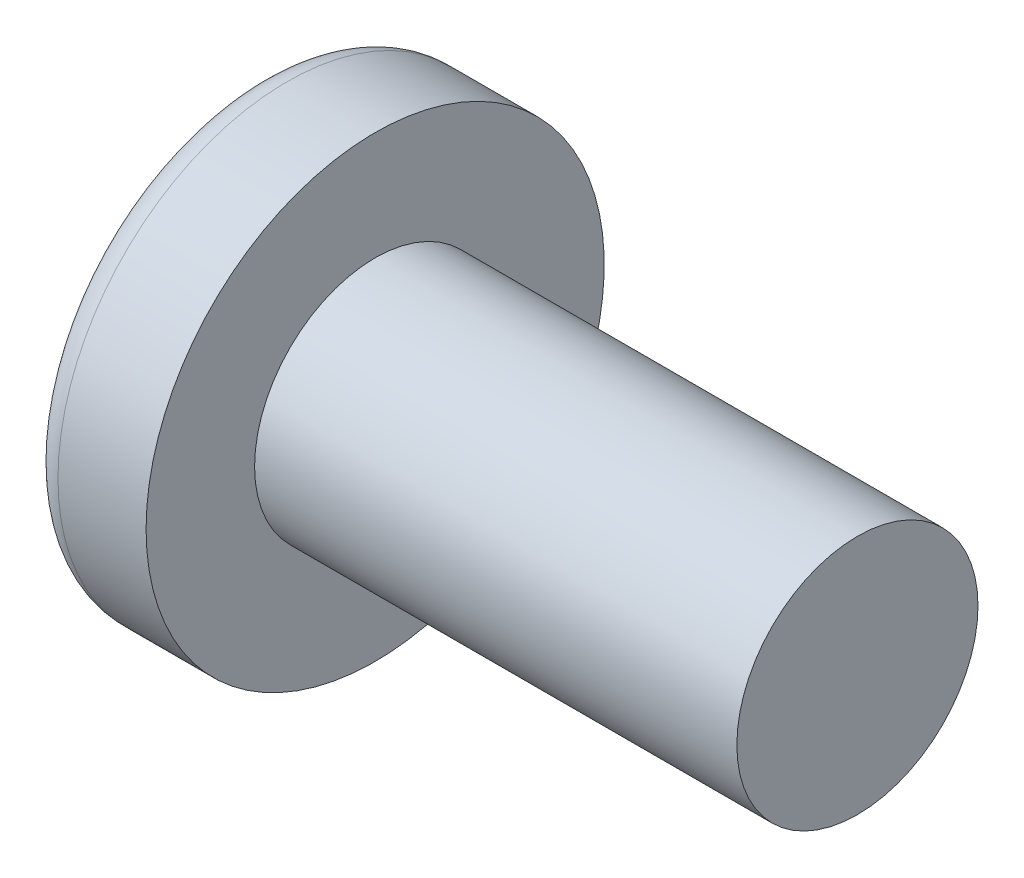
ISO-10303-21;
HEADER;
FILE_DESCRIPTION(('STEP AP214'),'2;1');
FILE_NAME('part.step','',(''),(''),'','','');
FILE_SCHEMA(('AUTOMOTIVE_DESIGN { 1 0 10303 214 1 1 1 1 }'));
ENDSEC;
DATA;
#1=APPLICATION_CONTEXT('core data for automotive mechanical design processes');
#2=APPLICATION_PROTOCOL_DEFINITION('international standard','automotive_design',2000,#1);
#3=PRODUCT_CONTEXT('',#1,'mechanical');
#4=PRODUCT('Part','Part','',(#3));
#5=PRODUCT_RELATED_PRODUCT_CATEGORY('part','',(#4));
#6=PRODUCT_DEFINITION_FORMATION('','',#4);
#7=PRODUCT_DEFINITION_CONTEXT('part definition',#1,'design');
#8=PRODUCT_DEFINITION('design','',#6,#7);
#9=PRODUCT_DEFINITION_SHAPE('','',#8);
#10=(LENGTH_UNIT() NAMED_UNIT(*) SI_UNIT(.MILLI.,.METRE.));
#11=(NAMED_UNIT(*) PLANE_ANGLE_UNIT() SI_UNIT($,.RADIAN.));
#12=(NAMED_UNIT(*) SI_UNIT($,.STERADIAN.) SOLID_ANGLE_UNIT());
#13=UNCERTAINTY_MEASURE_WITH_UNIT(LENGTH_MEASURE(1.E-05),#10,'distance_accuracy_value','');
#14=(GEOMETRIC_REPRESENTATION_CONTEXT(3) GLOBAL_UNCERTAINTY_ASSIGNED_CONTEXT((#13)) GLOBAL_UNIT_ASSIGNED_CONTEXT((#10,
#11,#12)) REPRESENTATION_CONTEXT('',''));
#15=CARTESIAN_POINT('',(0.,0.,0.));
#16=DIRECTION('',(0.,0.,1.));
#17=DIRECTION('',(1.,0.,0.));
#18=AXIS2_PLACEMENT_3D('',#15,#16,#17);
#19=CARTESIAN_POINT('',(2.95,0.25,-0.25));
#20=DIRECTION('',(-1.,0.,0.));
#21=DIRECTION('',(0.,0.,1.));
#22=AXIS2_PLACEMENT_3D('',#19,#20,#21);
#23=PLANE('',#22);
#24=DIRECTION('',(0.,1.,0.));
#25=VECTOR('',#24,1.);
#26=CARTESIAN_POINT('',(2.95,-0.250000000000001,0.249999999999999));
#27=LINE('',#26,#25);
#28=CARTESIAN_POINT('',(2.95,-0.250000000000001,0.25));
#29=VERTEX_POINT('',#28);
#30=CARTESIAN_POINT('',(2.95,0.25,0.25));
#31=VERTEX_POINT('',#30);
#32=EDGE_CURVE('E102',#29,#31,#27,.T.);
#33=ORIENTED_EDGE('',*,*,#32,.T.);
#34=DIRECTION('',(0.,0.,1.));
#35=VECTOR('',#34,1.);
#36=CARTESIAN_POINT('',(2.95,0.25,0.25));
#37=LINE('',#36,#35);
#38=CARTESIAN_POINT('',(2.95,0.250000000000001,-0.249999999999999));
#39=VERTEX_POINT('',#38);
#40=EDGE_CURVE('E210',#31,#39,#37,.F.);
#41=ORIENTED_EDGE('',*,*,#40,.T.);
#42=DIRECTION('',(0.,1.,0.));
#43=VECTOR('',#42,1.);
#44=CARTESIAN_POINT('',(2.95,0.250000000000001,-0.249999999999999));
#45=LINE('',#44,#43);
#46=CARTESIAN_POINT('',(2.95,-0.249999999999999,-0.25));
#47=VERTEX_POINT('',#46);
#48=EDGE_CURVE('E105',#39,#47,#45,.F.);
#49=ORIENTED_EDGE('',*,*,#48,.T.);
#50=DIRECTION('',(0.,0.,1.));
#51=VECTOR('',#50,1.);
#52=CARTESIAN_POINT('',(2.95,-0.25,-0.25));
#53=LINE('',#52,#51);
#54=EDGE_CURVE('E100',#47,#29,#53,.T.);
#55=ORIENTED_EDGE('',*,*,#54,.T.);
#56=EDGE_LOOP('',(#33,#41,#49,#55));
#57=FACE_BOUND('',#56,.T.);
#58=ADVANCED_FACE('F17',(#57),#23,.T.);
#59=CARTESIAN_POINT('',(2.95,0.250000000000001,-0.249999999999999));
#60=DIRECTION('',(0.597823879730417,0.,-0.801627475093059));
#61=DIRECTION('',(-0.801627475093059,0.,-0.597823879730417));
#62=AXIS2_PLACEMENT_3D('',#59,#60,#61);
#63=PLANE('',#62);
#64=ORIENTED_EDGE('',*,*,#48,.F.);
#65=DIRECTION('',(0.799784057588366,-0.0677783099651178,0.596449127693018));
#66=VECTOR('',#65,1.);
#67=CARTESIAN_POINT('',(0.325131322777775,0.472446498069688,-2.20752918301318));
#68=LINE('',#67,#66);
#69=CARTESIAN_POINT('',(0.325131322777776,0.472446498069688,-2.20752918301318));
#70=VERTEX_POINT('',#69);
#71=EDGE_CURVE('E166',#70,#39,#68,.T.);
#72=ORIENTED_EDGE('',*,*,#71,.F.);
#73=CARTESIAN_POINT('',(0.325131322777776,-0.472446498069672,-2.20752918301319));
#74=CARTESIAN_POINT('',(0.317157243119868,-0.314964332046446,-2.21347595428349));
#75=CARTESIAN_POINT('',(0.313170203290913,-0.157482166023219,-2.21644933991864));
#76=CARTESIAN_POINT('',(0.313170203290914,0.157482166023235,-2.21644933991864));
#77=CARTESIAN_POINT('',(0.317157243119869,0.314964332046461,-2.21347595428349));
#78=CARTESIAN_POINT('',(0.325131322777778,0.472446498069688,-2.20752918301319));
#79=B_SPLINE_CURVE_WITH_KNOTS('',3,(#73,#74,#75,#76,#77,#78),.UNSPECIFIED.,.F.,.F.,(4,2,4),(0.,
0.472682061344517,0.945364122689033),.UNSPECIFIED.);
#80=CARTESIAN_POINT('',(0.325131322777776,-0.472446498069672,-2.20752918301319));
#81=VERTEX_POINT('',#80);
#82=EDGE_CURVE('E20',#81,#70,#79,.T.);
#83=ORIENTED_EDGE('',*,*,#82,.F.);
#84=DIRECTION('',(-0.799784057588365,-0.0677783099651135,-0.596449127693019));
#85=VECTOR('',#84,1.);
#86=CARTESIAN_POINT('',(2.95,-0.249999999999999,-0.25));
#87=LINE('',#86,#85);
#88=EDGE_CURVE('E171',#47,#81,#87,.T.);
#89=ORIENTED_EDGE('',*,*,#88,.F.);
#90=EDGE_LOOP('',(#64,#72,#83,#89));
#91=FACE_BOUND('',#90,.T.);
#92=ADVANCED_FACE('F409',(#91),#63,.F.);
#93=CARTESIAN_POINT('',(2.95,0.25,0.25));
#94=DIRECTION('',(0.597823879730417,0.801627475093059,0.));
#95=DIRECTION('',(-0.801627475093059,0.597823879730417,0.));
#96=AXIS2_PLACEMENT_3D('',#93,#94,#95);
#97=PLANE('',#96);
#98=ORIENTED_EDGE('',*,*,#40,.F.);
#99=DIRECTION('',(0.799784057588365,-0.596449127693019,-0.0677783099651157));
#100=VECTOR('',#99,1.);
#101=CARTESIAN_POINT('',(0.325131322777776,2.20752918301319,0.47244649806968));
#102=LINE('',#101,#100);
#103=CARTESIAN_POINT('',(0.325131322777776,2.20752918301319,0.47244649806968));
#104=VERTEX_POINT('',#103);
#105=EDGE_CURVE('E151',#104,#31,#102,.T.);
#106=ORIENTED_EDGE('',*,*,#105,.F.);
#107=CARTESIAN_POINT('',(0.313170203290937,2.21644933991862,0.));
#108=CARTESIAN_POINT('',(0.313170203290937,2.21644933991862,0.236458871035968));
#109=CARTESIAN_POINT('',(0.325131322777776,2.20752918301318,0.47244649806968));
#110=B_SPLINE_CURVE_WITH_KNOTS('',2,(#107,#108,#109),.UNSPECIFIED.,.F.,.F.,(3,3),(0.,1.),.UNSPECIFIED.);
#111=CARTESIAN_POINT('',(0.313170203290937,2.21644933991862,0.));
#112=VERTEX_POINT('',#111);
#113=EDGE_CURVE('E443',#112,#104,#110,.T.);
#114=ORIENTED_EDGE('',*,*,#113,.F.);
#115=CARTESIAN_POINT('',(0.325131322777776,2.20752918301318,-0.47244649806968));
#116=CARTESIAN_POINT('',(0.313170203290937,2.21644933991862,-0.236458871035983));
#117=CARTESIAN_POINT('',(0.313170203290937,2.21644933991862,0.));
#118=B_SPLINE_CURVE_WITH_KNOTS('',2,(#115,#116,#117),.UNSPECIFIED.,.F.,.F.,(3,3),(0.,1.),.UNSPECIFIED.);
#119=CARTESIAN_POINT('',(0.325131322777776,2.20752918301318,-0.47244649806968));
#120=VERTEX_POINT('',#119);
#121=EDGE_CURVE('E431',#120,#112,#118,.T.);
#122=ORIENTED_EDGE('',*,*,#121,.F.);
#123=DIRECTION('',(-0.799784057588366,0.596449127693018,-0.0677783099651157));
#124=VECTOR('',#123,1.);
#125=CARTESIAN_POINT('',(2.95,0.250000000000001,-0.25));
#126=LINE('',#125,#124);
#127=EDGE_CURVE('E156',#39,#120,#126,.T.);
#128=ORIENTED_EDGE('',*,*,#127,.F.);
#129=EDGE_LOOP('',(#98,#106,#114,#122,#128));
#130=FACE_BOUND('',#129,.T.);
#131=ADVANCED_FACE('F203',(#130),#97,.F.);
#132=CARTESIAN_POINT('',(2.95,-0.250000000000001,0.249999999999999));
#133=DIRECTION('',(0.597823879730417,0.,0.801627475093059));
#134=DIRECTION('',(0.801627475093059,0.,-0.597823879730417));
#135=AXIS2_PLACEMENT_3D('',#132,#133,#134);
#136=PLANE('',#135);
#137=ORIENTED_EDGE('',*,*,#32,.F.);
#138=DIRECTION('',(0.799784057588365,0.0677783099651177,-0.596449127693018));
#139=VECTOR('',#138,1.);
#140=CARTESIAN_POINT('',(0.325131322777776,-0.472446498069688,2.20752918301318));
#141=LINE('',#140,#139);
#142=CARTESIAN_POINT('',(0.325131322777776,-0.472446498069688,2.20752918301318));
#143=VERTEX_POINT('',#142);
#144=EDGE_CURVE('E115',#143,#29,#141,.T.);
#145=ORIENTED_EDGE('',*,*,#144,.F.);
#146=CARTESIAN_POINT('',(0.325131322777776,0.472446498069672,2.20752918301318));
#147=CARTESIAN_POINT('',(0.317157243119868,0.314964332046445,2.21347595428349));
#148=CARTESIAN_POINT('',(0.313170203290914,0.157482166023219,2.21644933991864));
#149=CARTESIAN_POINT('',(0.313170203290914,-0.157482166023235,2.21644933991864));
#150=CARTESIAN_POINT('',(0.317157243119868,-0.314964332046462,2.21347595428349));
#151=CARTESIAN_POINT('',(0.325131322777777,-0.472446498069688,2.20752918301318));
#152=B_SPLINE_CURVE_WITH_KNOTS('',3,(#146,#147,#148,#149,#150,#151),.UNSPECIFIED.,.F.,.F.,(4,2,
4),(0.,0.472682061344517,0.945364122689033),.UNSPECIFIED.);
#153=CARTESIAN_POINT('',(0.325131322777776,0.472446498069672,2.20752918301319));
#154=VERTEX_POINT('',#153);
#155=EDGE_CURVE('E120',#154,#143,#152,.T.);
#156=ORIENTED_EDGE('',*,*,#155,.F.);
#157=DIRECTION('',(-0.799784057588365,0.0677783099651136,0.596449127693019));
#158=VECTOR('',#157,1.);
#159=CARTESIAN_POINT('',(2.95,0.249999999999999,0.25));
#160=LINE('',#159,#158);
#161=EDGE_CURVE('E118',#31,#154,#160,.T.);
#162=ORIENTED_EDGE('',*,*,#161,.F.);
#163=EDGE_LOOP('',(#137,#145,#156,#162));
#164=FACE_BOUND('',#163,.T.);
#165=ADVANCED_FACE('F114',(#164),#136,.F.);
#166=CARTESIAN_POINT('',(2.95,-0.25,-0.25));
#167=DIRECTION('',(0.597823879730417,-0.801627475093059,0.));
#168=DIRECTION('',(0.801627475093059,0.597823879730417,0.));
#169=AXIS2_PLACEMENT_3D('',#166,#167,#168);
#170=PLANE('',#169);
#171=ORIENTED_EDGE('',*,*,#54,.F.);
#172=DIRECTION('',(0.799784057588366,0.596449127693018,0.0677783099651157));
#173=VECTOR('',#172,1.);
#174=CARTESIAN_POINT('',(0.325131322777774,-2.20752918301319,-0.47244649806968));
#175=LINE('',#174,#173);
#176=CARTESIAN_POINT('',(0.325131322777774,-2.20752918301319,-0.47244649806968));
#177=VERTEX_POINT('',#176);
#178=EDGE_CURVE('E107',#177,#47,#175,.T.);
#179=ORIENTED_EDGE('',*,*,#178,.F.);
#180=CARTESIAN_POINT('',(0.313170203290936,-2.21644933991862,0.));
#181=CARTESIAN_POINT('',(0.313170203290936,-2.21644933991862,-0.236458871035945));
#182=CARTESIAN_POINT('',(0.325131322777774,-2.20752918301319,-0.47244649806968));
#183=B_SPLINE_CURVE_WITH_KNOTS('',2,(#180,#181,#182),.UNSPECIFIED.,.F.,.F.,(3,3),(0.,1.),.UNSPECIFIED.);
#184=CARTESIAN_POINT('',(0.313170203290936,-2.21644933991862,0.));
#185=VERTEX_POINT('',#184);
#186=EDGE_CURVE('E108',#185,#177,#183,.T.);
#187=ORIENTED_EDGE('',*,*,#186,.F.);
#188=CARTESIAN_POINT('',(0.325131322777774,-2.20752918301319,0.47244649806968));
#189=CARTESIAN_POINT('',(0.313170203290936,-2.21644933991862,0.236458871035945));
#190=CARTESIAN_POINT('',(0.313170203290936,-2.21644933991862,0.));
#191=B_SPLINE_CURVE_WITH_KNOTS('',2,(#188,#189,#190),.UNSPECIFIED.,.F.,.F.,(3,3),(0.,1.),.UNSPECIFIED.);
#192=CARTESIAN_POINT('',(0.325131322777774,-2.20752918301319,0.47244649806968));
#193=VERTEX_POINT('',#192);
#194=EDGE_CURVE('E40',#193,#185,#191,.T.);
#195=ORIENTED_EDGE('',*,*,#194,.F.);
#196=DIRECTION('',(-0.799784057588366,-0.596449127693018,0.0677783099651156));
#197=VECTOR('',#196,1.);
#198=CARTESIAN_POINT('',(2.95,-0.250000000000001,0.25));
#199=LINE('',#198,#197);
#200=EDGE_CURVE('E130',#29,#193,#199,.T.);
#201=ORIENTED_EDGE('',*,*,#200,.F.);
#202=EDGE_LOOP('',(#171,#179,#187,#195,#201));
#203=FACE_BOUND('',#202,.T.);
#204=ADVANCED_FACE('F131',(#203),#170,.F.);
#205=CARTESIAN_POINT('',(3.28522727272727,0.,-0.221590909090909));
#206=DIRECTION('',(-0.0844430766861806,0.,0.996428304896931));
#207=DIRECTION('',(0.996428304896931,0.,0.0844430766861806));
#208=AXIS2_PLACEMENT_3D('',#205,#206,#207);
#209=PLANE('',#208);
#210=DIRECTION('',(0.992894609445471,0.0841436109699547,0.0841436109699551));
#211=VECTOR('',#210,1.);
#212=CARTESIAN_POINT('',(0.0309826509964148,-0.497374351610471,-0.497374351610473));
#213=LINE('',#212,#211);
#214=CARTESIAN_POINT('',(0.030982650996415,-0.497374351610471,-0.497374351610472));
#215=VERTEX_POINT('',#214);
#216=EDGE_CURVE('E80',#215,#47,#213,.T.);
#217=ORIENTED_EDGE('',*,*,#216,.F.);
#218=CARTESIAN_POINT('',(0.325131322777774,-2.20752918301318,-0.472446498069679));
#219=CARTESIAN_POINT('',(0.305153387226559,-2.13771094335951,-0.474139543455376));
#220=CARTESIAN_POINT('',(0.286123713785529,-2.06761944085803,-0.475752227645294));
#221=CARTESIAN_POINT('',(0.250013835153148,-1.9270976357498,-0.478812386851428));
#222=CARTESIAN_POINT('',(0.232929415642028,-1.85666842385585,-0.480260219013388));
#223=CARTESIAN_POINT('',(0.20069835422625,-1.71547398814855,-0.482991664896081));
#224=CARTESIAN_POINT('',(0.185548895648011,-1.64470941191905,-0.484275517317965));
#225=CARTESIAN_POINT('',(0.157179934434219,-1.50284607536061,-0.486679666573371));
#226=CARTESIAN_POINT('',(0.143959014494,-1.43174760048809,-0.487800083517458));
#227=CARTESIAN_POINT('',(0.119443568908064,-1.28921692897808,-0.489877663651859));
#228=CARTESIAN_POINT('',(0.108149043262346,-1.21778473234058,-0.490834826842174));
#229=CARTESIAN_POINT('',(0.0874870349604675,-1.07458627039494,-0.492585844494876));
#230=CARTESIAN_POINT('',(0.0781209829467221,-1.0028197971749,-0.49337957771638));
#231=CARTESIAN_POINT('',(0.0613210228054141,-0.858952131813853,-0.494803303152083));
#232=CARTESIAN_POINT('',(0.0538899846767259,-0.786850602117612,-0.495433052146039));
#233=CARTESIAN_POINT('',(0.0409690682241692,-0.642311622846895,-0.49652804506575));
#234=CARTESIAN_POINT('',(0.0354835246910504,-0.569873782967428,-0.496992921636357));
#235=CARTESIAN_POINT('',(0.0309826509964257,-0.497374351610591,-0.497374351610489));
#236=B_SPLINE_CURVE_WITH_KNOTS('',3,(#218,#219,#220,#221,#222,#223,#224,#225,#226,#227,#228,
#229,#230,#231,#232,#233,#234,#235),.UNSPECIFIED.,.F.,.F.,(4,2,2,2,2,2,2,2,4),(0.,
0.217913247040374,0.435345029895688,0.652456605346115,0.869407810385238,1.08635901542436,
1.30347059087479,1.5209023737301,1.73881562077047),.UNSPECIFIED.);
#237=EDGE_CURVE('E134',#177,#215,#236,.T.);
#238=ORIENTED_EDGE('',*,*,#237,.F.);
#239=ORIENTED_EDGE('',*,*,#178,.T.);
#240=EDGE_LOOP('',(#217,#238,#239));
#241=FACE_BOUND('',#240,.T.);
#242=ADVANCED_FACE('F196',(#241),#209,.T.);
#243=CARTESIAN_POINT('',(3.28522727272727,-0.221590909090909,0.));
#244=DIRECTION('',(-0.0844430766861805,0.996428304896931,0.));
#245=DIRECTION('',(-0.996428304896931,-0.0844430766861805,0.));
#246=AXIS2_PLACEMENT_3D('',#243,#244,#245);
#247=PLANE('',#246);
#248=ORIENTED_EDGE('',*,*,#216,.T.);
#249=ORIENTED_EDGE('',*,*,#88,.T.);
#250=CARTESIAN_POINT('',(0.0309826509964153,-0.49737435161047,-0.497374351610471));
#251=CARTESIAN_POINT('',(0.0354835246910379,-0.49699292163635,-0.569873782967313));
#252=CARTESIAN_POINT('',(0.040969068224157,-0.496528045065747,-0.642311622846786));
#253=CARTESIAN_POINT('',(0.0538899846767152,-0.495433052146038,-0.786850602117513));
#254=CARTESIAN_POINT('',(0.0613210228054047,-0.494803303152081,-0.858952131813759));
#255=CARTESIAN_POINT('',(0.0781209829467118,-0.493379577716376,-1.00281979717481));
#256=CARTESIAN_POINT('',(0.0874870349604552,-0.492585844494872,-1.07458627039487));
#257=CARTESIAN_POINT('',(0.108149043262335,-0.49083482684217,-1.21778473234052));
#258=CARTESIAN_POINT('',(0.119443568908055,-0.489877663651855,-1.28921692897802));
#259=CARTESIAN_POINT('',(0.143959014493992,-0.487800083517453,-1.43174760048804));
#260=CARTESIAN_POINT('',(0.15717993443421,-0.486679666573366,-1.50284607536057));
#261=CARTESIAN_POINT('',(0.185548895648001,-0.48427551731796,-1.64470941191901));
#262=CARTESIAN_POINT('',(0.200698354226242,-0.482991664896075,-1.71547398814851));
#263=CARTESIAN_POINT('',(0.232929415642022,-0.480260219013381,-1.85666842385583));
#264=CARTESIAN_POINT('',(0.250013835153143,-0.478812386851421,-1.92709763574978));
#265=CARTESIAN_POINT('',(0.286123713785528,-0.475752227645287,-2.06761944085802));
#266=CARTESIAN_POINT('',(0.305153387226559,-0.474139543455369,-2.1377109433595));
#267=CARTESIAN_POINT('',(0.325131322777776,-0.472446498069672,-2.20752918301319));
#268=B_SPLINE_CURVE_WITH_KNOTS('',3,(#250,#251,#252,#253,#254,#255,#256,#257,#258,#259,#260,
#261,#262,#263,#264,#265,#266,#267),.UNSPECIFIED.,.F.,.F.,(4,2,2,2,2,2,2,2,4),(0.,
0.217913247040389,0.435345029895718,0.65245660534616,0.869407810385298,1.08635901542444,
1.30347059087488,1.52090237373021,1.7388156207706),.UNSPECIFIED.);
#269=EDGE_CURVE('E299',#215,#81,#268,.T.);
#270=ORIENTED_EDGE('',*,*,#269,.F.);
#271=EDGE_LOOP('',(#248,#249,#270));
#272=FACE_BOUND('',#271,.T.);
#273=ADVANCED_FACE('F307',(#272),#247,.T.);
#274=CARTESIAN_POINT('',(3.28522727272727,0.221590909090909,0.));
#275=DIRECTION('',(-0.0844430766861806,-0.996428304896931,0.));
#276=DIRECTION('',(0.996428304896931,-0.0844430766861806,0.));
#277=AXIS2_PLACEMENT_3D('',#274,#275,#276);
#278=PLANE('',#277);
#279=ORIENTED_EDGE('',*,*,#71,.T.);
#280=DIRECTION('',(0.992894609445471,-0.0841436109699554,0.0841436109699551));
#281=VECTOR('',#280,1.);
#282=CARTESIAN_POINT('',(0.0309826509964153,0.497374351610475,-0.497374351610473));
#283=LINE('',#282,#281);
#284=CARTESIAN_POINT('',(0.0309826509964153,0.497374351610475,-0.497374351610472));
#285=VERTEX_POINT('',#284);
#286=EDGE_CURVE('E161',#285,#39,#283,.T.);
#287=ORIENTED_EDGE('',*,*,#286,.F.);
#288=CARTESIAN_POINT('',(0.325131322777776,0.472446498069688,-2.20752918301318));
#289=CARTESIAN_POINT('',(0.305153387226559,0.474139543455384,-2.1377109433595));
#290=CARTESIAN_POINT('',(0.286123713785527,0.475752227645302,-2.06761944085802));
#291=CARTESIAN_POINT('',(0.250013835153143,0.478812386851435,-1.92709763574978));
#292=CARTESIAN_POINT('',(0.232929415642021,0.480260219013394,-1.85666842385583));
#293=CARTESIAN_POINT('',(0.200698354226242,0.482991664896087,-1.71547398814851));
#294=CARTESIAN_POINT('',(0.185548895648001,0.484275517317972,-1.64470941191901));
#295=CARTESIAN_POINT('',(0.15717993443421,0.486679666573377,-1.50284607536056));
#296=CARTESIAN_POINT('',(0.143959014493992,0.487800083517463,-1.43174760048804));
#297=CARTESIAN_POINT('',(0.119443568908056,0.489877663651864,-1.28921692897801));
#298=CARTESIAN_POINT('',(0.108149043262338,0.490834826842179,-1.21778473234051));
#299=CARTESIAN_POINT('',(0.0874870349604586,0.49258584449488,-1.07458627039486));
#300=CARTESIAN_POINT('',(0.0781209829467127,0.493379577716384,-1.00281979717481));
#301=CARTESIAN_POINT('',(0.0613210228054036,0.494803303152087,-0.858952131813759));
#302=CARTESIAN_POINT('',(0.0538899846767146,0.495433052146044,-0.786850602117513));
#303=CARTESIAN_POINT('',(0.0409690682241574,0.496528045065752,-0.642311622846785));
#304=CARTESIAN_POINT('',(0.0354835246910388,0.496992921636355,-0.569873782967313));
#305=CARTESIAN_POINT('',(0.0309826509964153,0.497374351610476,-0.497374351610471));
#306=B_SPLINE_CURVE_WITH_KNOTS('',3,(#288,#289,#290,#291,#292,#293,#294,#295,#296,#297,#298,
#299,#300,#301,#302,#303,#304,#305),.UNSPECIFIED.,.F.,.F.,(4,2,2,2,2,2,2,2,4),(0.,
0.217913247040389,0.435345029895717,0.652456605346159,0.869407810385297,1.08635901542443,
1.30347059087488,1.5209023737302,1.73881562077059),.UNSPECIFIED.);
#307=EDGE_CURVE('E293',#70,#285,#306,.T.);
#308=ORIENTED_EDGE('',*,*,#307,.F.);
#309=EDGE_LOOP('',(#279,#287,#308));
#310=FACE_BOUND('',#309,.T.);
#311=ADVANCED_FACE('F304',(#310),#278,.T.);
#312=CARTESIAN_POINT('',(3.28522727272727,0.,-0.221590909090909));
#313=DIRECTION('',(-0.0844430766861806,0.,0.996428304896931));
#314=DIRECTION('',(0.996428304896931,0.,0.0844430766861806));
#315=AXIS2_PLACEMENT_3D('',#312,#313,#314);
#316=PLANE('',#315);
#317=ORIENTED_EDGE('',*,*,#286,.T.);
#318=ORIENTED_EDGE('',*,*,#127,.T.);
#319=CARTESIAN_POINT('',(0.0309826509964153,0.497374351610476,-0.497374351610471));
#320=CARTESIAN_POINT('',(0.0354835246910411,0.569873782967317,-0.496992921636351));
#321=CARTESIAN_POINT('',(0.04096906822416,0.642311622846789,-0.496528045065749));
#322=CARTESIAN_POINT('',(0.0538899846767165,0.786850602117516,-0.495433052146041));
#323=CARTESIAN_POINT('',(0.0613210228054044,0.858952131813762,-0.494803303152084));
#324=CARTESIAN_POINT('',(0.0781209829467128,1.00281979717481,-0.49337957771638));
#325=CARTESIAN_POINT('',(0.0874870349604591,1.07458627039487,-0.492585844494876));
#326=CARTESIAN_POINT('',(0.108149043262337,1.21778473234052,-0.490834826842175));
#327=CARTESIAN_POINT('',(0.119443568908053,1.28921692897802,-0.48987766365186));
#328=CARTESIAN_POINT('',(0.143959014493988,1.43174760048804,-0.487800083517459));
#329=CARTESIAN_POINT('',(0.157179934434209,1.50284607536057,-0.486679666573372));
#330=CARTESIAN_POINT('',(0.185548895648003,1.64470941191901,-0.484275517317966));
#331=CARTESIAN_POINT('',(0.200698354226244,1.71547398814851,-0.482991664896081));
#332=CARTESIAN_POINT('',(0.232929415642023,1.85666842385583,-0.480260219013388));
#333=CARTESIAN_POINT('',(0.250013835153144,1.92709763574978,-0.478812386851429));
#334=CARTESIAN_POINT('',(0.286123713785526,2.06761944085802,-0.475752227645294));
#335=CARTESIAN_POINT('',(0.305153387226557,2.1377109433595,-0.474139543455376));
#336=CARTESIAN_POINT('',(0.325131322777774,2.20752918301318,-0.472446498069679));
#337=B_SPLINE_CURVE_WITH_KNOTS('',3,(#319,#320,#321,#322,#323,#324,#325,#326,#327,#328,#329,
#330,#331,#332,#333,#334,#335,#336),.UNSPECIFIED.,.F.,.F.,(4,2,2,2,2,2,2,2,4),(0.,
0.217913247040388,0.435345029895716,0.652456605346158,0.869407810385295,1.08635901542443,
1.30347059087487,1.5209023737302,1.73881562077059),.UNSPECIFIED.);
#338=EDGE_CURVE('E286',#285,#120,#337,.T.);
#339=ORIENTED_EDGE('',*,*,#338,.F.);
#340=EDGE_LOOP('',(#317,#318,#339));
#341=FACE_BOUND('',#340,.T.);
#342=ADVANCED_FACE('F275',(#341),#316,.T.);
#343=CARTESIAN_POINT('',(3.28522727272727,0.,0.221590909090909));
#344=DIRECTION('',(-0.0844430766861805,0.,-0.996428304896931));
#345=DIRECTION('',(-0.996428304896931,0.,0.0844430766861805));
#346=AXIS2_PLACEMENT_3D('',#343,#344,#345);
#347=PLANE('',#346);
#348=DIRECTION('',(0.992894609445471,-0.0841436109699548,-0.0841436109699551));
#349=VECTOR('',#348,1.);
#350=CARTESIAN_POINT('',(0.0309826509964152,0.497374351610471,0.497374351610473));
#351=LINE('',#350,#349);
#352=CARTESIAN_POINT('',(0.0309826509964153,0.497374351610472,0.497374351610473));
#353=VERTEX_POINT('',#352);
#354=EDGE_CURVE('E147',#353,#31,#351,.T.);
#355=ORIENTED_EDGE('',*,*,#354,.F.);
#356=CARTESIAN_POINT('',(0.325131322777774,2.20752918301319,0.472446498069681));
#357=CARTESIAN_POINT('',(0.305153387226559,2.13771094335951,0.474139543455377));
#358=CARTESIAN_POINT('',(0.28612371378553,2.06761944085803,0.475752227645294));
#359=CARTESIAN_POINT('',(0.25001383515315,1.9270976357498,0.478812386851428));
#360=CARTESIAN_POINT('',(0.23292941564203,1.85666842385585,0.480260219013387));
#361=CARTESIAN_POINT('',(0.200698354226252,1.71547398814855,0.48299166489608));
#362=CARTESIAN_POINT('',(0.185548895648011,1.64470941191905,0.484275517317965));
#363=CARTESIAN_POINT('',(0.157179934434218,1.50284607536062,0.486679666573371));
#364=CARTESIAN_POINT('',(0.143959014494,1.4317476004881,0.487800083517457));
#365=CARTESIAN_POINT('',(0.119443568908065,1.28921692897808,0.489877663651859));
#366=CARTESIAN_POINT('',(0.108149043262348,1.21778473234058,0.490834826842173));
#367=CARTESIAN_POINT('',(0.0874870349604691,1.07458627039495,0.492585844494875));
#368=CARTESIAN_POINT('',(0.0781209829467227,1.0028197971749,0.49337957771638));
#369=CARTESIAN_POINT('',(0.0613210228054139,0.858952131813855,0.494803303152083));
#370=CARTESIAN_POINT('',(0.0538899846767257,0.786850602117614,0.495433052146038));
#371=CARTESIAN_POINT('',(0.0409690682241693,0.642311622846896,0.49652804506575));
#372=CARTESIAN_POINT('',(0.0354835246910507,0.569873782967429,0.496992921636358));
#373=CARTESIAN_POINT('',(0.0309826509964257,0.497374351610593,0.49737435161049));
#374=B_SPLINE_CURVE_WITH_KNOTS('',3,(#356,#357,#358,#359,#360,#361,#362,#363,#364,#365,#366,
#367,#368,#369,#370,#371,#372,#373),.UNSPECIFIED.,.F.,.F.,(4,2,2,2,2,2,2,2,4),(0.,
0.217913247040374,0.435345029895687,0.652456605346115,0.869407810385237,1.08635901542436,
1.30347059087479,1.5209023737301,1.73881562077047),.UNSPECIFIED.);
#375=EDGE_CURVE('E279',#104,#353,#374,.T.);
#376=ORIENTED_EDGE('',*,*,#375,.F.);
#377=ORIENTED_EDGE('',*,*,#105,.T.);
#378=EDGE_LOOP('',(#355,#376,#377));
#379=FACE_BOUND('',#378,.T.);
#380=ADVANCED_FACE('F270',(#379),#347,.T.);
#381=CARTESIAN_POINT('',(3.28522727272727,0.221590909090909,0.));
#382=DIRECTION('',(-0.0844430766861806,-0.996428304896931,0.));
#383=DIRECTION('',(0.996428304896931,-0.0844430766861806,0.));
#384=AXIS2_PLACEMENT_3D('',#381,#382,#383);
#385=PLANE('',#384);
#386=ORIENTED_EDGE('',*,*,#354,.T.);
#387=ORIENTED_EDGE('',*,*,#161,.T.);
#388=CARTESIAN_POINT('',(0.0309826509964154,0.497374351610472,0.497374351610473));
#389=CARTESIAN_POINT('',(0.0354835246910402,0.496992921636351,0.569873782967315));
#390=CARTESIAN_POINT('',(0.0409690682241595,0.496528045065747,0.642311622846787));
#391=CARTESIAN_POINT('',(0.0538899846767165,0.495433052146038,0.786850602117514));
#392=CARTESIAN_POINT('',(0.0613210228054047,0.494803303152081,0.85895213181376));
#393=CARTESIAN_POINT('',(0.0781209829467114,0.493379577716377,1.00281979717481));
#394=CARTESIAN_POINT('',(0.0874870349604556,0.492585844494873,1.07458627039487));
#395=CARTESIAN_POINT('',(0.108149043262335,0.490834826842171,1.21778473234052));
#396=CARTESIAN_POINT('',(0.119443568908053,0.489877663651855,1.28921692897802));
#397=CARTESIAN_POINT('',(0.143959014493991,0.487800083517454,1.43174760048804));
#398=CARTESIAN_POINT('',(0.15717993443421,0.486679666573367,1.50284607536057));
#399=CARTESIAN_POINT('',(0.185548895648002,0.48427551731796,1.64470941191901));
#400=CARTESIAN_POINT('',(0.200698354226243,0.482991664896075,1.71547398814851));
#401=CARTESIAN_POINT('',(0.232929415642022,0.480260219013381,1.85666842385583));
#402=CARTESIAN_POINT('',(0.250013835153143,0.478812386851422,1.92709763574978));
#403=CARTESIAN_POINT('',(0.286123713785527,0.475752227645287,2.06761944085802));
#404=CARTESIAN_POINT('',(0.305153387226558,0.474139543455369,2.1377109433595));
#405=CARTESIAN_POINT('',(0.325131322777776,0.472446498069672,2.20752918301318));
#406=B_SPLINE_CURVE_WITH_KNOTS('',3,(#388,#389,#390,#391,#392,#393,#394,#395,#396,#397,#398,
#399,#400,#401,#402,#403,#404,#405),.UNSPECIFIED.,.F.,.F.,(4,2,2,2,2,2,2,2,4),(0.,
0.217913247040389,0.435345029895717,0.652456605346159,0.869407810385296,1.08635901542443,
1.30347059087488,1.5209023737302,1.73881562077059),.UNSPECIFIED.);
#407=EDGE_CURVE('E258',#353,#154,#406,.T.);
#408=ORIENTED_EDGE('',*,*,#407,.F.);
#409=EDGE_LOOP('',(#386,#387,#408));
#410=FACE_BOUND('',#409,.T.);
#411=ADVANCED_FACE('F266',(#410),#385,.T.);
#412=CARTESIAN_POINT('',(3.28522727272727,-0.221590909090909,0.));
#413=DIRECTION('',(-0.0844430766861805,0.996428304896931,0.));
#414=DIRECTION('',(-0.996428304896931,-0.0844430766861805,0.));
#415=AXIS2_PLACEMENT_3D('',#412,#413,#414);
#416=PLANE('',#415);
#417=ORIENTED_EDGE('',*,*,#144,.T.);
#418=DIRECTION('',(0.992894609445471,0.0841436109699554,-0.084143610969955));
#419=VECTOR('',#418,1.);
#420=CARTESIAN_POINT('',(0.0309826509964149,-0.497374351610475,0.497374351610473));
#421=LINE('',#420,#419);
#422=CARTESIAN_POINT('',(0.0309826509964151,-0.497374351610475,0.497374351610473));
#423=VERTEX_POINT('',#422);
#424=EDGE_CURVE('E125',#423,#29,#421,.T.);
#425=ORIENTED_EDGE('',*,*,#424,.F.);
#426=CARTESIAN_POINT('',(0.325131322777776,-0.472446498069689,2.20752918301318));
#427=CARTESIAN_POINT('',(0.30515338722656,-0.474139543455384,2.1377109433595));
#428=CARTESIAN_POINT('',(0.286123713785528,-0.475752227645302,2.06761944085802));
#429=CARTESIAN_POINT('',(0.250013835153143,-0.478812386851435,1.92709763574978));
#430=CARTESIAN_POINT('',(0.232929415642021,-0.480260219013394,1.85666842385583));
#431=CARTESIAN_POINT('',(0.200698354226242,-0.482991664896087,1.71547398814851));
#432=CARTESIAN_POINT('',(0.185548895648002,-0.484275517317971,1.64470941191901));
#433=CARTESIAN_POINT('',(0.15717993443421,-0.486679666573377,1.50284607536056));
#434=CARTESIAN_POINT('',(0.14395901449399,-0.487800083517463,1.43174760048804));
#435=CARTESIAN_POINT('',(0.119443568908053,-0.489877663651864,1.28921692897801));
#436=CARTESIAN_POINT('',(0.108149043262336,-0.490834826842179,1.21778473234051));
#437=CARTESIAN_POINT('',(0.0874870349604572,-0.49258584449488,1.07458627039487));
#438=CARTESIAN_POINT('',(0.0781209829467119,-0.493379577716384,1.00281979717481));
#439=CARTESIAN_POINT('',(0.0613210228054043,-0.494803303152087,0.85895213181376));
#440=CARTESIAN_POINT('',(0.0538899846767162,-0.495433052146044,0.786850602117513));
#441=CARTESIAN_POINT('',(0.0409690682241596,-0.496528045065751,0.642311622846787));
#442=CARTESIAN_POINT('',(0.0354835246910406,-0.496992921636354,0.569873782967315));
#443=CARTESIAN_POINT('',(0.0309826509964153,-0.497374351610474,0.497374351610473));
#444=B_SPLINE_CURVE_WITH_KNOTS('',3,(#426,#427,#428,#429,#430,#431,#432,#433,#434,#435,#436,
#437,#438,#439,#440,#441,#442,#443),.UNSPECIFIED.,.F.,.F.,(4,2,2,2,2,2,2,2,4),(0.,
0.217913247040388,0.435345029895716,0.652456605346158,0.869407810385295,1.08635901542443,
1.30347059087487,1.5209023737302,1.73881562077059),.UNSPECIFIED.);
#445=EDGE_CURVE('E128',#143,#423,#444,.T.);
#446=ORIENTED_EDGE('',*,*,#445,.F.);
#447=EDGE_LOOP('',(#417,#425,#446));
#448=FACE_BOUND('',#447,.T.);
#449=ADVANCED_FACE('F123',(#448),#416,.T.);
#450=CARTESIAN_POINT('',(3.28522727272727,0.,0.221590909090909));
#451=DIRECTION('',(-0.0844430766861805,0.,-0.996428304896931));
#452=DIRECTION('',(-0.996428304896931,0.,0.0844430766861805));
#453=AXIS2_PLACEMENT_3D('',#450,#451,#452);
#454=PLANE('',#453);
#455=ORIENTED_EDGE('',*,*,#424,.T.);
#456=ORIENTED_EDGE('',*,*,#200,.T.);
#457=CARTESIAN_POINT('',(0.0309826509964153,-0.497374351610474,0.497374351610473));
#458=CARTESIAN_POINT('',(0.0354835246910398,-0.569873782967316,0.496992921636352));
#459=CARTESIAN_POINT('',(0.0409690682241591,-0.642311622846788,0.496528045065749));
#460=CARTESIAN_POINT('',(0.0538899846767165,-0.786850602117515,0.49543305214604));
#461=CARTESIAN_POINT('',(0.061321022805405,-0.858952131813761,0.494803303152084));
#462=CARTESIAN_POINT('',(0.0781209829467116,-1.00281979717481,0.49337957771638));
#463=CARTESIAN_POINT('',(0.0874870349604554,-1.07458627039487,0.492585844494876));
#464=CARTESIAN_POINT('',(0.108149043262335,-1.21778473234052,0.490834826842174));
#465=CARTESIAN_POINT('',(0.119443568908054,-1.28921692897802,0.489877663651859));
#466=CARTESIAN_POINT('',(0.14395901449399,-1.43174760048804,0.487800083517458));
#467=CARTESIAN_POINT('',(0.157179934434208,-1.50284607536057,0.486679666573372));
#468=CARTESIAN_POINT('',(0.185548895648001,-1.64470941191901,0.484275517317966));
#469=CARTESIAN_POINT('',(0.200698354226244,-1.71547398814851,0.482991664896081));
#470=CARTESIAN_POINT('',(0.232929415642025,-1.85666842385583,0.480260219013387));
#471=CARTESIAN_POINT('',(0.250013835153145,-1.92709763574978,0.478812386851428));
#472=CARTESIAN_POINT('',(0.286123713785528,-2.06761944085802,0.475752227645294));
#473=CARTESIAN_POINT('',(0.305153387226558,-2.1377109433595,0.474139543455376));
#474=CARTESIAN_POINT('',(0.325131322777774,-2.20752918301319,0.472446498069681));
#475=B_SPLINE_CURVE_WITH_KNOTS('',3,(#457,#458,#459,#460,#461,#462,#463,#464,#465,#466,#467,
#468,#469,#470,#471,#472,#473,#474),.UNSPECIFIED.,.F.,.F.,(4,2,2,2,2,2,2,2,4),(0.,
0.217913247040389,0.435345029895717,0.652456605346159,0.869407810385297,1.08635901542443,
1.30347059087488,1.5209023737302,1.73881562077059),.UNSPECIFIED.);
#476=EDGE_CURVE('E137',#423,#193,#475,.T.);
#477=ORIENTED_EDGE('',*,*,#476,.F.);
#478=EDGE_LOOP('',(#455,#456,#477));
#479=FACE_BOUND('',#478,.T.);
#480=ADVANCED_FACE('F136',(#479),#454,.T.);
#481=CARTESIAN_POINT('',(8.,0.,0.));
#482=DIRECTION('',(0.,1.,0.));
#483=DIRECTION('',(1.,0.,0.));
#484=AXIS2_PLACEMENT_3D('',#481,#482,#483);
#485=SPHERICAL_SURFACE('',#484,8.);
#486=CARTESIAN_POINT('',(1.37644815778014,0.,0.));
#487=DIRECTION('',(-1.,0.,0.));
#488=DIRECTION('',(0.,0.,1.));
#489=AXIS2_PLACEMENT_3D('',#486,#487,#488);
#490=CIRCLE('',#489,4.48648648648649);
#491=CARTESIAN_POINT('',(1.37644815778014,0.,4.48648648648649));
#492=VERTEX_POINT('',#491);
#493=EDGE_CURVE('E237',#492,#492,#490,.F.);
#494=ORIENTED_EDGE('',*,*,#493,.F.);
#495=EDGE_LOOP('',(#494));
#496=FACE_BOUND('',#495,.T.);
#497=ORIENTED_EDGE('',*,*,#476,.T.);
#498=ORIENTED_EDGE('',*,*,#194,.T.);
#499=ORIENTED_EDGE('',*,*,#186,.T.);
#500=ORIENTED_EDGE('',*,*,#237,.T.);
#501=ORIENTED_EDGE('',*,*,#269,.T.);
#502=ORIENTED_EDGE('',*,*,#82,.T.);
#503=ORIENTED_EDGE('',*,*,#307,.T.);
#504=ORIENTED_EDGE('',*,*,#338,.T.);
#505=ORIENTED_EDGE('',*,*,#121,.T.);
#506=ORIENTED_EDGE('',*,*,#113,.T.);
#507=ORIENTED_EDGE('',*,*,#375,.T.);
#508=ORIENTED_EDGE('',*,*,#407,.T.);
#509=ORIENTED_EDGE('',*,*,#155,.T.);
#510=ORIENTED_EDGE('',*,*,#445,.T.);
#511=EDGE_LOOP('',(#497,#498,#499,#500,#501,#502,#503,#504,#505,#506,#507,#508,#509,#510));
#512=FACE_BOUND('',#511,.T.);
#513=ADVANCED_FACE('F216',(#496,#512),#485,.T.);
#514=CARTESIAN_POINT('',(1.87321454594663,0.,0.));
#515=DIRECTION('',(-1.,0.,0.));
#516=DIRECTION('',(0.,0.,1.));
#517=AXIS2_PLACEMENT_3D('',#514,#515,#516);
#518=TOROIDAL_SURFACE('',#517,4.15,0.6);
#519=ORIENTED_EDGE('',*,*,#493,.T.);
#520=EDGE_LOOP('',(#519));
#521=FACE_BOUND('',#520,.T.);
#522=CARTESIAN_POINT('',(1.87321454594663,0.,0.));
#523=DIRECTION('',(-1.,0.,0.));
#524=DIRECTION('',(0.,0.,1.));
#525=AXIS2_PLACEMENT_3D('',#522,#523,#524);
#526=CIRCLE('',#525,4.75);
#527=CARTESIAN_POINT('',(1.87321454594663,0.,4.75));
#528=VERTEX_POINT('',#527);
#529=EDGE_CURVE('E234',#528,#528,#526,.F.);
#530=ORIENTED_EDGE('',*,*,#529,.F.);
#531=EDGE_LOOP('',(#530));
#532=FACE_BOUND('',#531,.T.);
#533=ADVANCED_FACE('F222',(#521,#532),#518,.T.);
#534=CARTESIAN_POINT('',(-25.4,0.,0.));
#535=DIRECTION('',(-1.,0.,0.));
#536=DIRECTION('',(0.,0.,1.));
#537=AXIS2_PLACEMENT_3D('',#534,#535,#536);
#538=CYLINDRICAL_SURFACE('',#537,4.75);
#539=ORIENTED_EDGE('',*,*,#529,.T.);
#540=EDGE_LOOP('',(#539));
#541=FACE_BOUND('',#540,.T.);
#542=CARTESIAN_POINT('',(3.7,0.,0.));
#543=DIRECTION('',(-1.,0.,0.));
#544=DIRECTION('',(0.,0.,1.));
#545=AXIS2_PLACEMENT_3D('',#542,#543,#544);
#546=CIRCLE('',#545,4.75);
#547=CARTESIAN_POINT('',(3.7,0.,4.75));
#548=VERTEX_POINT('',#547);
#549=EDGE_CURVE('E236',#548,#548,#546,.T.);
#550=ORIENTED_EDGE('',*,*,#549,.T.);
#551=EDGE_LOOP('',(#550));
#552=FACE_BOUND('',#551,.T.);
#553=ADVANCED_FACE('F330',(#541,#552),#538,.T.);
#554=CARTESIAN_POINT('',(13.7,2.5,0.));
#555=DIRECTION('',(1.,0.,0.));
#556=DIRECTION('',(0.,0.,-1.));
#557=AXIS2_PLACEMENT_3D('',#554,#555,#556);
#558=PLANE('',#557);
#559=CARTESIAN_POINT('',(13.7,0.,0.));
#560=DIRECTION('',(-1.,0.,0.));
#561=DIRECTION('',(0.,0.,1.));
#562=AXIS2_PLACEMENT_3D('',#559,#560,#561);
#563=CIRCLE('',#562,2.5);
#564=CARTESIAN_POINT('',(13.7,0.,2.5));
#565=VERTEX_POINT('',#564);
#566=EDGE_CURVE('E31',#565,#565,#563,.T.);
#567=ORIENTED_EDGE('',*,*,#566,.F.);
#568=EDGE_LOOP('',(#567));
#569=FACE_BOUND('',#568,.T.);
#570=ADVANCED_FACE('F324',(#569),#558,.T.);
#571=CARTESIAN_POINT('',(3.7,2.5,0.));
#572=DIRECTION('',(-1.,0.,0.));
#573=DIRECTION('',(0.,0.,1.));
#574=AXIS2_PLACEMENT_3D('',#571,#572,#573);
#575=PLANE('',#574);
#576=CARTESIAN_POINT('',(3.7,0.,0.));
#577=DIRECTION('',(-1.,0.,0.));
#578=DIRECTION('',(0.,0.,1.));
#579=AXIS2_PLACEMENT_3D('',#576,#577,#578);
#580=CIRCLE('',#579,2.5);
#581=CARTESIAN_POINT('',(3.7,0.,2.5));
#582=VERTEX_POINT('',#581);
#583=EDGE_CURVE('E11',#582,#582,#580,.F.);
#584=ORIENTED_EDGE('',*,*,#583,.F.);
#585=EDGE_LOOP('',(#584));
#586=FACE_BOUND('',#585,.T.);
#587=ORIENTED_EDGE('',*,*,#549,.F.);
#588=EDGE_LOOP('',(#587));
#589=FACE_BOUND('',#588,.T.);
#590=ADVANCED_FACE('F318',(#586,#589),#575,.F.);
#591=CARTESIAN_POINT('',(-25.4,0.,0.));
#592=DIRECTION('',(-1.,0.,0.));
#593=DIRECTION('',(0.,0.,1.));
#594=AXIS2_PLACEMENT_3D('',#591,#592,#593);
#595=CYLINDRICAL_SURFACE('',#594,2.5);
#596=ORIENTED_EDGE('',*,*,#583,.T.);
#597=EDGE_LOOP('',(#596));
#598=FACE_BOUND('',#597,.T.);
#599=ORIENTED_EDGE('',*,*,#566,.T.);
#600=EDGE_LOOP('',(#599));
#601=FACE_BOUND('',#600,.T.);
#602=ADVANCED_FACE('F316',(#598,#601),#595,.T.);
#603=CLOSED_SHELL('',(#58,#92,#131,#165,#204,#242,#273,#311,#342,#380,#411,#449,#480,#513,#533,
#553,#570,#590,#602));
#604=MANIFOLD_SOLID_BREP('B1',#603);
#605=ADVANCED_BREP_SHAPE_REPRESENTATION('',(#18,#604),#14);
#606=SHAPE_DEFINITION_REPRESENTATION(#9,#605);
ENDSEC;
END-ISO-10303-21;
